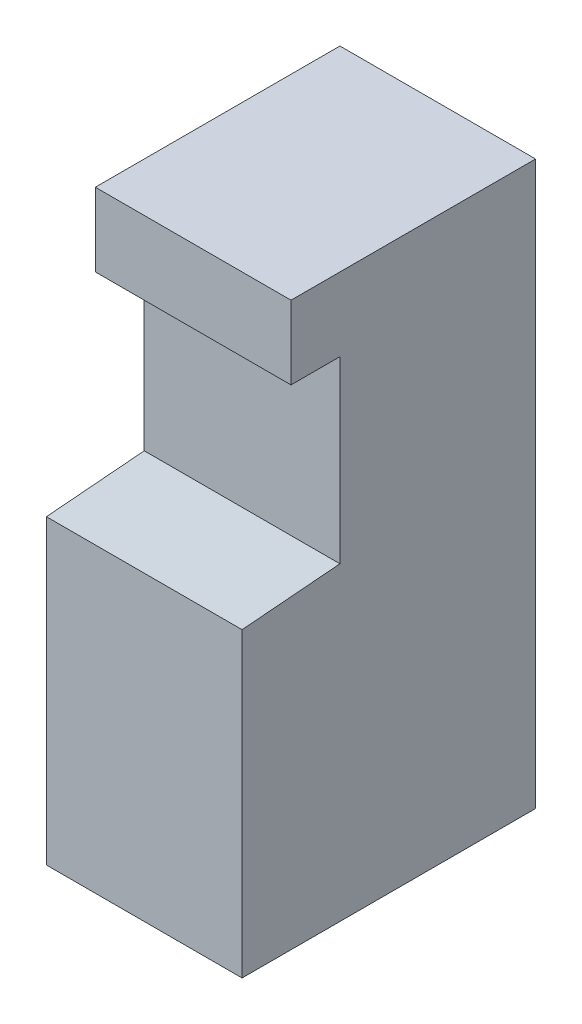
ISO-10303-21;
HEADER;
FILE_DESCRIPTION(('STEP AP214'),'2;1');
FILE_NAME('part.step','',(''),(''),'','','');
FILE_SCHEMA(('AUTOMOTIVE_DESIGN { 1 0 10303 214 1 1 1 1 }'));
ENDSEC;
DATA;
#1=APPLICATION_CONTEXT('core data for automotive mechanical design processes');
#2=APPLICATION_PROTOCOL_DEFINITION('international standard','automotive_design',2000,#1);
#3=PRODUCT_CONTEXT('',#1,'mechanical');
#4=PRODUCT('Part','Part','',(#3));
#5=PRODUCT_RELATED_PRODUCT_CATEGORY('part','',(#4));
#6=PRODUCT_DEFINITION_FORMATION('','',#4);
#7=PRODUCT_DEFINITION_CONTEXT('part definition',#1,'design');
#8=PRODUCT_DEFINITION('design','',#6,#7);
#9=PRODUCT_DEFINITION_SHAPE('','',#8);
#10=(LENGTH_UNIT() NAMED_UNIT(*) SI_UNIT(.MILLI.,.METRE.));
#11=(NAMED_UNIT(*) PLANE_ANGLE_UNIT() SI_UNIT($,.RADIAN.));
#12=(NAMED_UNIT(*) SI_UNIT($,.STERADIAN.) SOLID_ANGLE_UNIT());
#13=UNCERTAINTY_MEASURE_WITH_UNIT(LENGTH_MEASURE(1.E-05),#10,'distance_accuracy_value','');
#14=(GEOMETRIC_REPRESENTATION_CONTEXT(3) GLOBAL_UNCERTAINTY_ASSIGNED_CONTEXT((#13)) GLOBAL_UNIT_ASSIGNED_CONTEXT((#10,
#11,#12)) REPRESENTATION_CONTEXT('',''));
#15=CARTESIAN_POINT('',(0.,0.,0.));
#16=DIRECTION('',(0.,0.,1.));
#17=DIRECTION('',(1.,0.,0.));
#18=AXIS2_PLACEMENT_3D('',#15,#16,#17);
#19=CARTESIAN_POINT('',(0.,1524.,609.6));
#20=DIRECTION('',(0.,0.,-1.));
#21=DIRECTION('',(-1.,0.,0.));
#22=AXIS2_PLACEMENT_3D('',#19,#20,#21);
#23=PLANE('',#22);
#24=DIRECTION('',(1.,0.,0.));
#25=VECTOR('',#24,1.);
#26=CARTESIAN_POINT('',(0.,1524.,609.6));
#27=LINE('',#26,#25);
#28=CARTESIAN_POINT('',(0.,1524.,609.6));
#29=VERTEX_POINT('',#28);
#30=CARTESIAN_POINT('',(609.6,1524.,609.6));
#31=VERTEX_POINT('',#30);
#32=EDGE_CURVE('E117',#29,#31,#27,.T.);
#33=ORIENTED_EDGE('',*,*,#32,.F.);
#34=DIRECTION('',(0.,-1.,0.));
#35=VECTOR('',#34,1.);
#36=CARTESIAN_POINT('',(0.,1524.,609.6));
#37=LINE('',#36,#35);
#38=CARTESIAN_POINT('',(0.,965.2,609.6));
#39=VERTEX_POINT('',#38);
#40=EDGE_CURVE('E122',#29,#39,#37,.T.);
#41=ORIENTED_EDGE('',*,*,#40,.T.);
#42=DIRECTION('',(-1.,0.,0.));
#43=VECTOR('',#42,1.);
#44=CARTESIAN_POINT('',(0.,965.2,609.6));
#45=LINE('',#44,#43);
#46=CARTESIAN_POINT('',(609.6,965.2,609.6));
#47=VERTEX_POINT('',#46);
#48=EDGE_CURVE('E146',#47,#39,#45,.T.);
#49=ORIENTED_EDGE('',*,*,#48,.F.);
#50=DIRECTION('',(0.,-1.,0.));
#51=VECTOR('',#50,1.);
#52=CARTESIAN_POINT('',(609.6,1524.,609.6));
#53=LINE('',#52,#51);
#54=EDGE_CURVE('E135',#31,#47,#53,.T.);
#55=ORIENTED_EDGE('',*,*,#54,.F.);
#56=EDGE_LOOP('',(#33,#41,#49,#55));
#57=FACE_BOUND('',#56,.T.);
#58=ADVANCED_FACE('F33',(#57),#23,.F.);
#59=CARTESIAN_POINT('',(0.,939.8,0.));
#60=DIRECTION('',(1.,0.,0.));
#61=DIRECTION('',(0.,0.,-1.));
#62=AXIS2_PLACEMENT_3D('',#59,#60,#61);
#63=PLANE('',#62);
#64=DIRECTION('',(0.,-1.,0.));
#65=VECTOR('',#64,1.);
#66=CARTESIAN_POINT('',(1.11981703314034E-13,939.8,914.4));
#67=LINE('',#66,#65);
#68=CARTESIAN_POINT('',(1.11981703314034E-13,939.8,914.4));
#69=VERTEX_POINT('',#68);
#70=CARTESIAN_POINT('',(1.11981703314034E-13,0.,914.4));
#71=VERTEX_POINT('',#70);
#72=EDGE_CURVE('E11',#69,#71,#67,.T.);
#73=ORIENTED_EDGE('',*,*,#72,.F.);
#74=DIRECTION('',(0.,-0.0830454798537399,0.99654575824488));
#75=VECTOR('',#74,1.);
#76=CARTESIAN_POINT('',(0.,965.2,609.6));
#77=LINE('',#76,#75);
#78=EDGE_CURVE('E138',#39,#69,#77,.T.);
#79=ORIENTED_EDGE('',*,*,#78,.F.);
#80=ORIENTED_EDGE('',*,*,#40,.F.);
#81=DIRECTION('',(0.,0.,-1.));
#82=VECTOR('',#81,1.);
#83=CARTESIAN_POINT('',(0.,1524.,762.));
#84=LINE('',#83,#82);
#85=CARTESIAN_POINT('',(0.,1524.,762.));
#86=VERTEX_POINT('',#85);
#87=EDGE_CURVE('E100',#86,#29,#84,.T.);
#88=ORIENTED_EDGE('',*,*,#87,.F.);
#89=DIRECTION('',(0.,-1.,0.));
#90=VECTOR('',#89,1.);
#91=CARTESIAN_POINT('',(0.,1752.6,762.));
#92=LINE('',#91,#90);
#93=CARTESIAN_POINT('',(0.,1752.6,762.));
#94=VERTEX_POINT('',#93);
#95=EDGE_CURVE('E108',#94,#86,#92,.T.);
#96=ORIENTED_EDGE('',*,*,#95,.F.);
#97=DIRECTION('',(0.,0.,1.));
#98=VECTOR('',#97,1.);
#99=CARTESIAN_POINT('',(0.,1752.6,0.));
#100=LINE('',#99,#98);
#101=CARTESIAN_POINT('',(0.,1752.6,0.));
#102=VERTEX_POINT('',#101);
#103=EDGE_CURVE('E123',#102,#94,#100,.T.);
#104=ORIENTED_EDGE('',*,*,#103,.F.);
#105=DIRECTION('',(0.,-1.,0.));
#106=VECTOR('',#105,1.);
#107=CARTESIAN_POINT('',(0.,939.8,0.));
#108=LINE('',#107,#106);
#109=CARTESIAN_POINT('',(0.,0.,0.));
#110=VERTEX_POINT('',#109);
#111=EDGE_CURVE('E157',#102,#110,#108,.T.);
#112=ORIENTED_EDGE('',*,*,#111,.T.);
#113=DIRECTION('',(0.,0.,1.));
#114=VECTOR('',#113,1.);
#115=CARTESIAN_POINT('',(0.,0.,0.));
#116=LINE('',#115,#114);
#117=EDGE_CURVE('E149',#110,#71,#116,.T.);
#118=ORIENTED_EDGE('',*,*,#117,.T.);
#119=EDGE_LOOP('',(#73,#79,#80,#88,#96,#104,#112,#118));
#120=FACE_BOUND('',#119,.T.);
#121=ADVANCED_FACE('F35',(#120),#63,.F.);
#122=CARTESIAN_POINT('',(1.11981703314034E-13,939.8,914.4));
#123=DIRECTION('',(0.,0.,-1.));
#124=DIRECTION('',(-1.,0.,0.));
#125=AXIS2_PLACEMENT_3D('',#122,#123,#124);
#126=PLANE('',#125);
#127=DIRECTION('',(0.,-1.,0.));
#128=VECTOR('',#127,1.);
#129=CARTESIAN_POINT('',(609.6,939.8,914.4));
#130=LINE('',#129,#128);
#131=CARTESIAN_POINT('',(609.6,939.8,914.4));
#132=VERTEX_POINT('',#131);
#133=CARTESIAN_POINT('',(609.6,0.,914.4));
#134=VERTEX_POINT('',#133);
#135=EDGE_CURVE('E41',#132,#134,#130,.T.);
#136=ORIENTED_EDGE('',*,*,#135,.F.);
#137=DIRECTION('',(-1.,0.,0.));
#138=VECTOR('',#137,1.);
#139=CARTESIAN_POINT('',(609.6,939.8,914.4));
#140=LINE('',#139,#138);
#141=EDGE_CURVE('E142',#132,#69,#140,.T.);
#142=ORIENTED_EDGE('',*,*,#141,.T.);
#143=ORIENTED_EDGE('',*,*,#72,.T.);
#144=DIRECTION('',(1.,0.,0.));
#145=VECTOR('',#144,1.);
#146=CARTESIAN_POINT('',(1.11981703314034E-13,0.,914.4));
#147=LINE('',#146,#145);
#148=EDGE_CURVE('E152',#71,#134,#147,.T.);
#149=ORIENTED_EDGE('',*,*,#148,.T.);
#150=EDGE_LOOP('',(#136,#142,#143,#149));
#151=FACE_BOUND('',#150,.T.);
#152=ADVANCED_FACE('F165',(#151),#126,.F.);
#153=CARTESIAN_POINT('',(609.6,939.8,0.));
#154=DIRECTION('',(-1.,0.,0.));
#155=DIRECTION('',(0.,0.,1.));
#156=AXIS2_PLACEMENT_3D('',#153,#154,#155);
#157=PLANE('',#156);
#158=DIRECTION('',(0.,-1.,0.));
#159=VECTOR('',#158,1.);
#160=CARTESIAN_POINT('',(609.6,939.8,0.));
#161=LINE('',#160,#159);
#162=CARTESIAN_POINT('',(609.6,1752.6,0.));
#163=VERTEX_POINT('',#162);
#164=CARTESIAN_POINT('',(609.6,0.,0.));
#165=VERTEX_POINT('',#164);
#166=EDGE_CURVE('E159',#163,#165,#161,.T.);
#167=ORIENTED_EDGE('',*,*,#166,.F.);
#168=DIRECTION('',(0.,0.,-1.));
#169=VECTOR('',#168,1.);
#170=CARTESIAN_POINT('',(609.6,1752.6,0.));
#171=LINE('',#170,#169);
#172=CARTESIAN_POINT('',(609.6,1752.6,762.));
#173=VERTEX_POINT('',#172);
#174=EDGE_CURVE('E125',#173,#163,#171,.T.);
#175=ORIENTED_EDGE('',*,*,#174,.F.);
#176=DIRECTION('',(0.,1.,0.));
#177=VECTOR('',#176,1.);
#178=CARTESIAN_POINT('',(609.6,1752.6,762.));
#179=LINE('',#178,#177);
#180=CARTESIAN_POINT('',(609.6,1524.,762.));
#181=VERTEX_POINT('',#180);
#182=EDGE_CURVE('E107',#181,#173,#179,.T.);
#183=ORIENTED_EDGE('',*,*,#182,.F.);
#184=DIRECTION('',(0.,0.,-1.));
#185=VECTOR('',#184,1.);
#186=CARTESIAN_POINT('',(609.6,1524.,762.));
#187=LINE('',#186,#185);
#188=EDGE_CURVE('E103',#181,#31,#187,.T.);
#189=ORIENTED_EDGE('',*,*,#188,.T.);
#190=ORIENTED_EDGE('',*,*,#54,.T.);
#191=DIRECTION('',(0.,-0.0830454798537399,0.99654575824488));
#192=VECTOR('',#191,1.);
#193=CARTESIAN_POINT('',(609.6,965.2,609.6));
#194=LINE('',#193,#192);
#195=EDGE_CURVE('E139',#47,#132,#194,.T.);
#196=ORIENTED_EDGE('',*,*,#195,.T.);
#197=ORIENTED_EDGE('',*,*,#135,.T.);
#198=DIRECTION('',(0.,0.,-1.));
#199=VECTOR('',#198,1.);
#200=CARTESIAN_POINT('',(609.6,0.,0.));
#201=LINE('',#200,#199);
#202=EDGE_CURVE('E56',#134,#165,#201,.T.);
#203=ORIENTED_EDGE('',*,*,#202,.T.);
#204=EDGE_LOOP('',(#167,#175,#183,#189,#190,#196,#197,#203));
#205=FACE_BOUND('',#204,.T.);
#206=ADVANCED_FACE('F161',(#205),#157,.F.);
#207=CARTESIAN_POINT('',(0.,939.8,0.));
#208=DIRECTION('',(0.,0.,1.));
#209=DIRECTION('',(1.,0.,0.));
#210=AXIS2_PLACEMENT_3D('',#207,#208,#209);
#211=PLANE('',#210);
#212=DIRECTION('',(-1.,0.,0.));
#213=VECTOR('',#212,1.);
#214=CARTESIAN_POINT('',(0.,0.,0.));
#215=LINE('',#214,#213);
#216=EDGE_CURVE('E48',#165,#110,#215,.T.);
#217=ORIENTED_EDGE('',*,*,#216,.T.);
#218=ORIENTED_EDGE('',*,*,#111,.F.);
#219=DIRECTION('',(-1.,0.,0.));
#220=VECTOR('',#219,1.);
#221=CARTESIAN_POINT('',(0.,1752.6,0.));
#222=LINE('',#221,#220);
#223=EDGE_CURVE('E132',#163,#102,#222,.T.);
#224=ORIENTED_EDGE('',*,*,#223,.F.);
#225=ORIENTED_EDGE('',*,*,#166,.T.);
#226=EDGE_LOOP('',(#217,#218,#224,#225));
#227=FACE_BOUND('',#226,.T.);
#228=ADVANCED_FACE('F170',(#227),#211,.F.);
#229=CARTESIAN_POINT('',(0.,0.,0.));
#230=DIRECTION('',(0.,1.,0.));
#231=DIRECTION('',(0.,0.,1.));
#232=AXIS2_PLACEMENT_3D('',#229,#230,#231);
#233=PLANE('',#232);
#234=ORIENTED_EDGE('',*,*,#117,.F.);
#235=ORIENTED_EDGE('',*,*,#216,.F.);
#236=ORIENTED_EDGE('',*,*,#202,.F.);
#237=ORIENTED_EDGE('',*,*,#148,.F.);
#238=EDGE_LOOP('',(#234,#235,#236,#237));
#239=FACE_BOUND('',#238,.T.);
#240=ADVANCED_FACE('F168',(#239),#233,.F.);
#241=CARTESIAN_POINT('',(609.6,965.2,609.6));
#242=DIRECTION('',(0.,-0.99654575824488,-0.0830454798537399));
#243=DIRECTION('',(0.,0.0830454798537399,-0.99654575824488));
#244=AXIS2_PLACEMENT_3D('',#241,#242,#243);
#245=PLANE('',#244);
#246=ORIENTED_EDGE('',*,*,#78,.T.);
#247=ORIENTED_EDGE('',*,*,#141,.F.);
#248=ORIENTED_EDGE('',*,*,#195,.F.);
#249=ORIENTED_EDGE('',*,*,#48,.T.);
#250=EDGE_LOOP('',(#246,#247,#248,#249));
#251=FACE_BOUND('',#250,.T.);
#252=ADVANCED_FACE('F179',(#251),#245,.F.);
#253=CARTESIAN_POINT('',(0.,1752.6,0.));
#254=DIRECTION('',(0.,1.,0.));
#255=DIRECTION('',(0.,0.,1.));
#256=AXIS2_PLACEMENT_3D('',#253,#254,#255);
#257=PLANE('',#256);
#258=ORIENTED_EDGE('',*,*,#103,.T.);
#259=DIRECTION('',(-1.,0.,0.));
#260=VECTOR('',#259,1.);
#261=CARTESIAN_POINT('',(0.,1752.6,762.));
#262=LINE('',#261,#260);
#263=EDGE_CURVE('E114',#173,#94,#262,.T.);
#264=ORIENTED_EDGE('',*,*,#263,.F.);
#265=ORIENTED_EDGE('',*,*,#174,.T.);
#266=ORIENTED_EDGE('',*,*,#223,.T.);
#267=EDGE_LOOP('',(#258,#264,#265,#266));
#268=FACE_BOUND('',#267,.T.);
#269=ADVANCED_FACE('F172',(#268),#257,.T.);
#270=CARTESIAN_POINT('',(0.,1524.,762.));
#271=DIRECTION('',(0.,1.,0.));
#272=DIRECTION('',(0.,0.,1.));
#273=AXIS2_PLACEMENT_3D('',#270,#271,#272);
#274=PLANE('',#273);
#275=ORIENTED_EDGE('',*,*,#32,.T.);
#276=ORIENTED_EDGE('',*,*,#188,.F.);
#277=DIRECTION('',(1.,0.,0.));
#278=VECTOR('',#277,1.);
#279=CARTESIAN_POINT('',(0.,1524.,762.));
#280=LINE('',#279,#278);
#281=EDGE_CURVE('E96',#86,#181,#280,.T.);
#282=ORIENTED_EDGE('',*,*,#281,.F.);
#283=ORIENTED_EDGE('',*,*,#87,.T.);
#284=EDGE_LOOP('',(#275,#276,#282,#283));
#285=FACE_BOUND('',#284,.T.);
#286=ADVANCED_FACE('F98',(#285),#274,.F.);
#287=CARTESIAN_POINT('',(0.,0.,762.));
#288=DIRECTION('',(0.,0.,1.));
#289=DIRECTION('',(1.,0.,0.));
#290=AXIS2_PLACEMENT_3D('',#287,#288,#289);
#291=PLANE('',#290);
#292=ORIENTED_EDGE('',*,*,#95,.T.);
#293=ORIENTED_EDGE('',*,*,#281,.T.);
#294=ORIENTED_EDGE('',*,*,#182,.T.);
#295=ORIENTED_EDGE('',*,*,#263,.T.);
#296=EDGE_LOOP('',(#292,#293,#294,#295));
#297=FACE_BOUND('',#296,.T.);
#298=ADVANCED_FACE('F112',(#297),#291,.T.);
#299=CLOSED_SHELL('',(#58,#121,#152,#206,#228,#240,#252,#269,#286,#298));
#300=MANIFOLD_SOLID_BREP('B2',#299);
#301=ADVANCED_BREP_SHAPE_REPRESENTATION('',(#18,#300),#14);
#302=SHAPE_DEFINITION_REPRESENTATION(#9,#301);
ENDSEC;
END-ISO-10303-21;
